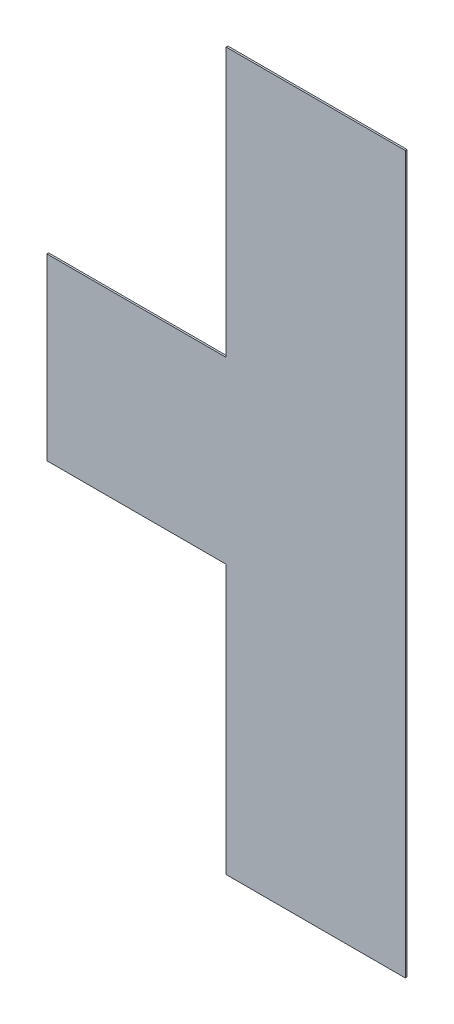
ISO-10303-21;
HEADER;
FILE_DESCRIPTION(('STEP AP214'),'2;1');
FILE_NAME('part.step','',(''),(''),'','','');
FILE_SCHEMA(('AUTOMOTIVE_DESIGN { 1 0 10303 214 1 1 1 1 }'));
ENDSEC;
DATA;
#1=APPLICATION_CONTEXT('core data for automotive mechanical design processes');
#2=APPLICATION_PROTOCOL_DEFINITION('international standard','automotive_design',2000,#1);
#3=PRODUCT_CONTEXT('',#1,'mechanical');
#4=PRODUCT('Part','Part','',(#3));
#5=PRODUCT_RELATED_PRODUCT_CATEGORY('part','',(#4));
#6=PRODUCT_DEFINITION_FORMATION('','',#4);
#7=PRODUCT_DEFINITION_CONTEXT('part definition',#1,'design');
#8=PRODUCT_DEFINITION('design','',#6,#7);
#9=PRODUCT_DEFINITION_SHAPE('','',#8);
#10=(LENGTH_UNIT() NAMED_UNIT(*) SI_UNIT(.MILLI.,.METRE.));
#11=(NAMED_UNIT(*) PLANE_ANGLE_UNIT() SI_UNIT($,.RADIAN.));
#12=(NAMED_UNIT(*) SI_UNIT($,.STERADIAN.) SOLID_ANGLE_UNIT());
#13=UNCERTAINTY_MEASURE_WITH_UNIT(LENGTH_MEASURE(1.E-05),#10,'distance_accuracy_value','');
#14=(GEOMETRIC_REPRESENTATION_CONTEXT(3) GLOBAL_UNCERTAINTY_ASSIGNED_CONTEXT((#13)) GLOBAL_UNIT_ASSIGNED_CONTEXT((#10,
#11,#12)) REPRESENTATION_CONTEXT('',''));
#15=CARTESIAN_POINT('',(0.,0.,0.));
#16=DIRECTION('',(0.,0.,1.));
#17=DIRECTION('',(1.,0.,0.));
#18=AXIS2_PLACEMENT_3D('',#15,#16,#17);
#19=CARTESIAN_POINT('',(0.200000000000008,0.399999999999998,0.002));
#20=DIRECTION('',(0.,0.,1.));
#21=DIRECTION('',(0.,-1.,0.));
#22=AXIS2_PLACEMENT_3D('',#19,#20,#21);
#23=PLANE('',#22);
#24=DIRECTION('',(1.,0.,0.));
#25=VECTOR('',#24,1.);
#26=CARTESIAN_POINT('',(0.,-0.0999999999999994,0.002));
#27=LINE('',#26,#25);
#28=CARTESIAN_POINT('',(0.,-0.0999999999999994,0.002));
#29=VERTEX_POINT('',#28);
#30=CARTESIAN_POINT('',(-0.199999999999991,-0.0999999999999994,0.002));
#31=VERTEX_POINT('',#30);
#32=EDGE_CURVE('E90',#29,#31,#27,.F.);
#33=ORIENTED_EDGE('',*,*,#32,.F.);
#34=DIRECTION('',(0.,1.,0.));
#35=VECTOR('',#34,1.);
#36=CARTESIAN_POINT('',(0.,-0.400000000000067,0.002));
#37=LINE('',#36,#35);
#38=CARTESIAN_POINT('',(0.,-0.400000000000067,0.002));
#39=VERTEX_POINT('',#38);
#40=EDGE_CURVE('E88',#39,#29,#37,.T.);
#41=ORIENTED_EDGE('',*,*,#40,.F.);
#42=DIRECTION('',(1.,0.,0.));
#43=VECTOR('',#42,1.);
#44=CARTESIAN_POINT('',(0.200000000000009,-0.400000000000067,0.002));
#45=LINE('',#44,#43);
#46=CARTESIAN_POINT('',(0.200000000000009,-0.400000000000067,0.002));
#47=VERTEX_POINT('',#46);
#48=EDGE_CURVE('E89',#47,#39,#45,.F.);
#49=ORIENTED_EDGE('',*,*,#48,.F.);
#50=DIRECTION('',(0.,1.,0.));
#51=VECTOR('',#50,1.);
#52=CARTESIAN_POINT('',(0.200000000000008,0.399999999999998,0.002));
#53=LINE('',#52,#51);
#54=CARTESIAN_POINT('',(0.200000000000008,0.399999999999998,0.002));
#55=VERTEX_POINT('',#54);
#56=EDGE_CURVE('E83',#55,#47,#53,.F.);
#57=ORIENTED_EDGE('',*,*,#56,.F.);
#58=DIRECTION('',(1.,0.,0.));
#59=VECTOR('',#58,1.);
#60=CARTESIAN_POINT('',(0.200000000000008,0.399999999999998,0.002));
#61=LINE('',#60,#59);
#62=CARTESIAN_POINT('',(0.,0.399999999999998,0.002));
#63=VERTEX_POINT('',#62);
#64=EDGE_CURVE('E145',#55,#63,#61,.F.);
#65=ORIENTED_EDGE('',*,*,#64,.T.);
#66=DIRECTION('',(0.,1.,0.));
#67=VECTOR('',#66,1.);
#68=CARTESIAN_POINT('',(0.,0.399999999999998,0.002));
#69=LINE('',#68,#67);
#70=CARTESIAN_POINT('',(0.,0.100000000000038,0.002));
#71=VERTEX_POINT('',#70);
#72=EDGE_CURVE('E134',#63,#71,#69,.F.);
#73=ORIENTED_EDGE('',*,*,#72,.T.);
#74=DIRECTION('',(1.,0.,0.));
#75=VECTOR('',#74,1.);
#76=CARTESIAN_POINT('',(0.,0.100000000000038,0.002));
#77=LINE('',#76,#75);
#78=CARTESIAN_POINT('',(-0.199999999999991,0.100000000000069,0.002));
#79=VERTEX_POINT('',#78);
#80=EDGE_CURVE('E56',#71,#79,#77,.F.);
#81=ORIENTED_EDGE('',*,*,#80,.T.);
#82=DIRECTION('',(0.,1.,0.));
#83=VECTOR('',#82,1.);
#84=CARTESIAN_POINT('',(-0.199999999999991,-0.0999999999999994,0.002));
#85=LINE('',#84,#83);
#86=EDGE_CURVE('E50',#31,#79,#85,.T.);
#87=ORIENTED_EDGE('',*,*,#86,.F.);
#88=EDGE_LOOP('',(#33,#41,#49,#57,#65,#73,#81,#87));
#89=FACE_BOUND('',#88,.T.);
#90=ADVANCED_FACE('F17',(#89),#23,.T.);
#91=CARTESIAN_POINT('',(0.200000000000008,0.399999999999998,0.));
#92=DIRECTION('',(1.,0.,0.));
#93=DIRECTION('',(0.,0.,-1.));
#94=AXIS2_PLACEMENT_3D('',#91,#92,#93);
#95=PLANE('',#94);
#96=DIRECTION('',(0.,0.,-1.));
#97=VECTOR('',#96,1.);
#98=CARTESIAN_POINT('',(0.200000000000008,0.399999999999998,0.));
#99=LINE('',#98,#97);
#100=CARTESIAN_POINT('',(0.200000000000008,0.399999999999998,0.));
#101=VERTEX_POINT('',#100);
#102=EDGE_CURVE('E152',#101,#55,#99,.F.);
#103=ORIENTED_EDGE('',*,*,#102,.T.);
#104=ORIENTED_EDGE('',*,*,#56,.T.);
#105=DIRECTION('',(0.,0.,-1.));
#106=VECTOR('',#105,1.);
#107=CARTESIAN_POINT('',(0.200000000000009,-0.400000000000067,0.));
#108=LINE('',#107,#106);
#109=CARTESIAN_POINT('',(0.200000000000009,-0.400000000000067,0.));
#110=VERTEX_POINT('',#109);
#111=EDGE_CURVE('E96',#110,#47,#108,.F.);
#112=ORIENTED_EDGE('',*,*,#111,.F.);
#113=DIRECTION('',(0.,-1.,0.));
#114=VECTOR('',#113,1.);
#115=CARTESIAN_POINT('',(0.200000000000008,0.399999999999998,0.));
#116=LINE('',#115,#114);
#117=EDGE_CURVE('E97',#110,#101,#116,.F.);
#118=ORIENTED_EDGE('',*,*,#117,.T.);
#119=EDGE_LOOP('',(#103,#104,#112,#118));
#120=FACE_BOUND('',#119,.T.);
#121=ADVANCED_FACE('F178',(#120),#95,.T.);
#122=CARTESIAN_POINT('',(0.200000000000008,0.399999999999998,0.));
#123=DIRECTION('',(0.,-1.,0.));
#124=DIRECTION('',(0.,0.,-1.));
#125=AXIS2_PLACEMENT_3D('',#122,#123,#124);
#126=PLANE('',#125);
#127=ORIENTED_EDGE('',*,*,#64,.F.);
#128=ORIENTED_EDGE('',*,*,#102,.F.);
#129=DIRECTION('',(1.,0.,0.));
#130=VECTOR('',#129,1.);
#131=CARTESIAN_POINT('',(0.200000000000008,0.399999999999998,0.));
#132=LINE('',#131,#130);
#133=CARTESIAN_POINT('',(0.,0.399999999999998,0.));
#134=VERTEX_POINT('',#133);
#135=EDGE_CURVE('E139',#101,#134,#132,.F.);
#136=ORIENTED_EDGE('',*,*,#135,.T.);
#137=DIRECTION('',(0.,0.,-1.));
#138=VECTOR('',#137,1.);
#139=CARTESIAN_POINT('',(0.,0.399999999999998,0.));
#140=LINE('',#139,#138);
#141=EDGE_CURVE('E142',#134,#63,#140,.F.);
#142=ORIENTED_EDGE('',*,*,#141,.T.);
#143=EDGE_LOOP('',(#127,#128,#136,#142));
#144=FACE_BOUND('',#143,.T.);
#145=ADVANCED_FACE('F172',(#144),#126,.F.);
#146=CARTESIAN_POINT('',(0.,0.399999999999998,0.));
#147=DIRECTION('',(1.,0.,0.));
#148=DIRECTION('',(0.,0.,-1.));
#149=AXIS2_PLACEMENT_3D('',#146,#147,#148);
#150=PLANE('',#149);
#151=ORIENTED_EDGE('',*,*,#72,.F.);
#152=ORIENTED_EDGE('',*,*,#141,.F.);
#153=DIRECTION('',(0.,-1.,0.));
#154=VECTOR('',#153,1.);
#155=CARTESIAN_POINT('',(0.,0.399999999999998,0.));
#156=LINE('',#155,#154);
#157=CARTESIAN_POINT('',(0.,0.100000000000038,0.));
#158=VERTEX_POINT('',#157);
#159=EDGE_CURVE('E128',#134,#158,#156,.T.);
#160=ORIENTED_EDGE('',*,*,#159,.T.);
#161=DIRECTION('',(0.,0.,-1.));
#162=VECTOR('',#161,1.);
#163=CARTESIAN_POINT('',(0.,0.100000000000038,0.));
#164=LINE('',#163,#162);
#165=EDGE_CURVE('E131',#158,#71,#164,.F.);
#166=ORIENTED_EDGE('',*,*,#165,.T.);
#167=EDGE_LOOP('',(#151,#152,#160,#166));
#168=FACE_BOUND('',#167,.T.);
#169=ADVANCED_FACE('F170',(#168),#150,.F.);
#170=CARTESIAN_POINT('',(0.,0.100000000000038,0.));
#171=DIRECTION('',(0.,-1.,0.));
#172=DIRECTION('',(0.,0.,-1.));
#173=AXIS2_PLACEMENT_3D('',#170,#171,#172);
#174=PLANE('',#173);
#175=ORIENTED_EDGE('',*,*,#80,.F.);
#176=ORIENTED_EDGE('',*,*,#165,.F.);
#177=DIRECTION('',(1.,0.,0.));
#178=VECTOR('',#177,1.);
#179=CARTESIAN_POINT('',(0.200000000000009,0.100000000000038,0.));
#180=LINE('',#179,#178);
#181=CARTESIAN_POINT('',(-0.199999999999991,0.100000000000069,0.));
#182=VERTEX_POINT('',#181);
#183=EDGE_CURVE('E115',#158,#182,#180,.F.);
#184=ORIENTED_EDGE('',*,*,#183,.T.);
#185=DIRECTION('',(0.,0.,1.));
#186=VECTOR('',#185,1.);
#187=CARTESIAN_POINT('',(-0.199999999999991,0.100000000000069,0.));
#188=LINE('',#187,#186);
#189=EDGE_CURVE('E119',#79,#182,#188,.F.);
#190=ORIENTED_EDGE('',*,*,#189,.F.);
#191=EDGE_LOOP('',(#175,#176,#184,#190));
#192=FACE_BOUND('',#191,.T.);
#193=ADVANCED_FACE('F191',(#192),#174,.F.);
#194=CARTESIAN_POINT('',(-0.199999999999991,-0.0999999999999994,0.));
#195=DIRECTION('',(-1.,0.,0.));
#196=DIRECTION('',(0.,0.,1.));
#197=AXIS2_PLACEMENT_3D('',#194,#195,#196);
#198=PLANE('',#197);
#199=DIRECTION('',(0.,0.,-1.));
#200=VECTOR('',#199,1.);
#201=CARTESIAN_POINT('',(-0.199999999999991,-0.0999999999999994,0.));
#202=LINE('',#201,#200);
#203=CARTESIAN_POINT('',(-0.199999999999991,-0.0999999999999994,0.));
#204=VERTEX_POINT('',#203);
#205=EDGE_CURVE('E20',#31,#204,#202,.T.);
#206=ORIENTED_EDGE('',*,*,#205,.F.);
#207=ORIENTED_EDGE('',*,*,#86,.T.);
#208=ORIENTED_EDGE('',*,*,#189,.T.);
#209=DIRECTION('',(0.,-1.,0.));
#210=VECTOR('',#209,1.);
#211=CARTESIAN_POINT('',(-0.2,0.399999999999998,0.));
#212=LINE('',#211,#210);
#213=EDGE_CURVE('E112',#182,#204,#212,.T.);
#214=ORIENTED_EDGE('',*,*,#213,.T.);
#215=EDGE_LOOP('',(#206,#207,#208,#214));
#216=FACE_BOUND('',#215,.T.);
#217=ADVANCED_FACE('F188',(#216),#198,.T.);
#218=CARTESIAN_POINT('',(0.,-0.0999999999999994,0.));
#219=DIRECTION('',(0.,-1.,0.));
#220=DIRECTION('',(0.,0.,-1.));
#221=AXIS2_PLACEMENT_3D('',#218,#219,#220);
#222=PLANE('',#221);
#223=DIRECTION('',(0.,0.,1.));
#224=VECTOR('',#223,1.);
#225=CARTESIAN_POINT('',(0.,-0.0999999999999994,0.));
#226=LINE('',#225,#224);
#227=CARTESIAN_POINT('',(0.,-0.0999999999999994,0.));
#228=VERTEX_POINT('',#227);
#229=EDGE_CURVE('E93',#29,#228,#226,.F.);
#230=ORIENTED_EDGE('',*,*,#229,.F.);
#231=ORIENTED_EDGE('',*,*,#32,.T.);
#232=ORIENTED_EDGE('',*,*,#205,.T.);
#233=DIRECTION('',(1.,0.,0.));
#234=VECTOR('',#233,1.);
#235=CARTESIAN_POINT('',(0.200000000000009,-0.0999999999999994,0.));
#236=LINE('',#235,#234);
#237=EDGE_CURVE('E111',#204,#228,#236,.T.);
#238=ORIENTED_EDGE('',*,*,#237,.T.);
#239=EDGE_LOOP('',(#230,#231,#232,#238));
#240=FACE_BOUND('',#239,.T.);
#241=ADVANCED_FACE('F185',(#240),#222,.T.);
#242=CARTESIAN_POINT('',(0.,-0.400000000000067,0.));
#243=DIRECTION('',(-1.,0.,0.));
#244=DIRECTION('',(0.,0.,1.));
#245=AXIS2_PLACEMENT_3D('',#242,#243,#244);
#246=PLANE('',#245);
#247=DIRECTION('',(0.,0.,-1.));
#248=VECTOR('',#247,1.);
#249=CARTESIAN_POINT('',(0.,-0.400000000000067,0.));
#250=LINE('',#249,#248);
#251=CARTESIAN_POINT('',(0.,-0.400000000000067,0.));
#252=VERTEX_POINT('',#251);
#253=EDGE_CURVE('E34',#39,#252,#250,.T.);
#254=ORIENTED_EDGE('',*,*,#253,.F.);
#255=ORIENTED_EDGE('',*,*,#40,.T.);
#256=ORIENTED_EDGE('',*,*,#229,.T.);
#257=DIRECTION('',(0.,-1.,0.));
#258=VECTOR('',#257,1.);
#259=CARTESIAN_POINT('',(0.,0.399999999999998,0.));
#260=LINE('',#259,#258);
#261=EDGE_CURVE('E26',#228,#252,#260,.T.);
#262=ORIENTED_EDGE('',*,*,#261,.T.);
#263=EDGE_LOOP('',(#254,#255,#256,#262));
#264=FACE_BOUND('',#263,.T.);
#265=ADVANCED_FACE('F100',(#264),#246,.T.);
#266=CARTESIAN_POINT('',(0.200000000000009,-0.400000000000067,0.));
#267=DIRECTION('',(0.,-1.,0.));
#268=DIRECTION('',(0.,0.,-1.));
#269=AXIS2_PLACEMENT_3D('',#266,#267,#268);
#270=PLANE('',#269);
#271=ORIENTED_EDGE('',*,*,#111,.T.);
#272=ORIENTED_EDGE('',*,*,#48,.T.);
#273=ORIENTED_EDGE('',*,*,#253,.T.);
#274=DIRECTION('',(1.,0.,0.));
#275=VECTOR('',#274,1.);
#276=CARTESIAN_POINT('',(0.200000000000009,-0.400000000000067,0.));
#277=LINE('',#276,#275);
#278=EDGE_CURVE('E11',#252,#110,#277,.T.);
#279=ORIENTED_EDGE('',*,*,#278,.T.);
#280=EDGE_LOOP('',(#271,#272,#273,#279));
#281=FACE_BOUND('',#280,.T.);
#282=ADVANCED_FACE('F95',(#281),#270,.T.);
#283=CARTESIAN_POINT('',(0.200000000000008,0.399999999999998,0.));
#284=DIRECTION('',(0.,0.,1.));
#285=DIRECTION('',(0.,-1.,0.));
#286=AXIS2_PLACEMENT_3D('',#283,#284,#285);
#287=PLANE('',#286);
#288=ORIENTED_EDGE('',*,*,#261,.F.);
#289=ORIENTED_EDGE('',*,*,#237,.F.);
#290=ORIENTED_EDGE('',*,*,#213,.F.);
#291=ORIENTED_EDGE('',*,*,#183,.F.);
#292=ORIENTED_EDGE('',*,*,#159,.F.);
#293=ORIENTED_EDGE('',*,*,#135,.F.);
#294=ORIENTED_EDGE('',*,*,#117,.F.);
#295=ORIENTED_EDGE('',*,*,#278,.F.);
#296=EDGE_LOOP('',(#288,#289,#290,#291,#292,#293,#294,#295));
#297=FACE_BOUND('',#296,.T.);
#298=ADVANCED_FACE('F176',(#297),#287,.F.);
#299=CLOSED_SHELL('',(#90,#121,#145,#169,#193,#217,#241,#265,#282,#298));
#300=MANIFOLD_SOLID_BREP('B1',#299);
#301=ADVANCED_BREP_SHAPE_REPRESENTATION('',(#18,#300),#14);
#302=SHAPE_DEFINITION_REPRESENTATION(#9,#301);
ENDSEC;
END-ISO-10303-21;
